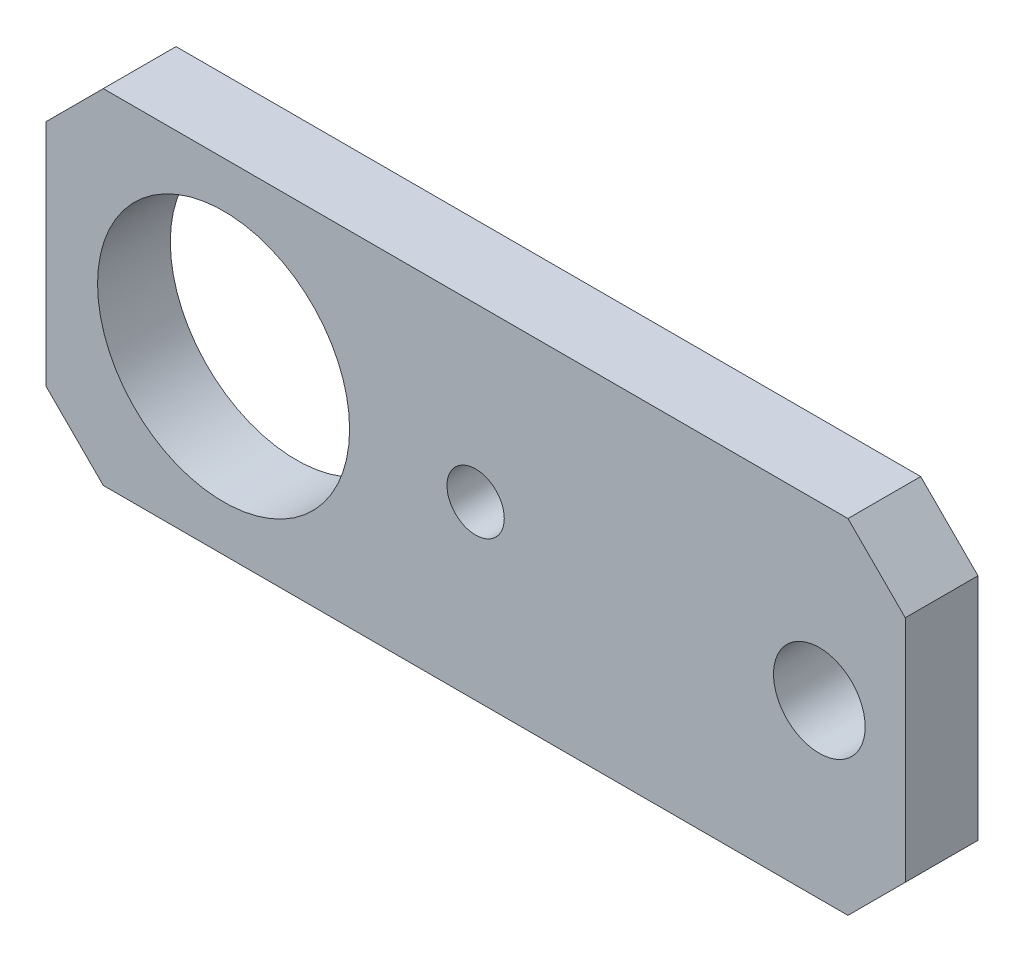
ISO-10303-21;
HEADER;
FILE_DESCRIPTION(('STEP AP214'),'2;1');
FILE_NAME('part.step','',(''),(''),'','','');
FILE_SCHEMA(('AUTOMOTIVE_DESIGN { 1 0 10303 214 1 1 1 1 }'));
ENDSEC;
DATA;
#1=APPLICATION_CONTEXT('core data for automotive mechanical design processes');
#2=APPLICATION_PROTOCOL_DEFINITION('international standard','automotive_design',2000,#1);
#3=PRODUCT_CONTEXT('',#1,'mechanical');
#4=PRODUCT('Part','Part','',(#3));
#5=PRODUCT_RELATED_PRODUCT_CATEGORY('part','',(#4));
#6=PRODUCT_DEFINITION_FORMATION('','',#4);
#7=PRODUCT_DEFINITION_CONTEXT('part definition',#1,'design');
#8=PRODUCT_DEFINITION('design','',#6,#7);
#9=PRODUCT_DEFINITION_SHAPE('','',#8);
#10=(LENGTH_UNIT() NAMED_UNIT(*) SI_UNIT(.MILLI.,.METRE.));
#11=(NAMED_UNIT(*) PLANE_ANGLE_UNIT() SI_UNIT($,.RADIAN.));
#12=(NAMED_UNIT(*) SI_UNIT($,.STERADIAN.) SOLID_ANGLE_UNIT());
#13=UNCERTAINTY_MEASURE_WITH_UNIT(LENGTH_MEASURE(1.E-05),#10,'distance_accuracy_value','');
#14=(GEOMETRIC_REPRESENTATION_CONTEXT(3) GLOBAL_UNCERTAINTY_ASSIGNED_CONTEXT((#13)) GLOBAL_UNIT_ASSIGNED_CONTEXT((#10,
#11,#12)) REPRESENTATION_CONTEXT('',''));
#15=CARTESIAN_POINT('',(0.,0.,0.));
#16=DIRECTION('',(0.,0.,1.));
#17=DIRECTION('',(1.,0.,0.));
#18=AXIS2_PLACEMENT_3D('',#15,#16,#17);
#19=CARTESIAN_POINT('',(0.,0.,6.35));
#20=DIRECTION('',(0.,0.,1.));
#21=DIRECTION('',(1.,0.,0.));
#22=AXIS2_PLACEMENT_3D('',#19,#20,#21);
#23=PLANE('',#22);
#24=CARTESIAN_POINT('',(0.,0.,6.35));
#25=DIRECTION('',(0.,0.,1.));
#26=DIRECTION('',(1.,0.,0.));
#27=AXIS2_PLACEMENT_3D('',#24,#25,#26);
#28=CIRCLE('',#27,2.5);
#29=CARTESIAN_POINT('',(2.5,0.,6.35));
#30=VERTEX_POINT('',#29);
#31=EDGE_CURVE('E179',#30,#30,#28,.T.);
#32=ORIENTED_EDGE('',*,*,#31,.F.);
#33=EDGE_LOOP('',(#32));
#34=FACE_BOUND('',#33,.T.);
#35=DIRECTION('',(1.,0.,0.));
#36=VECTOR('',#35,1.);
#37=CARTESIAN_POINT('',(-37.5,-15.,6.35));
#38=LINE('',#37,#36);
#39=CARTESIAN_POINT('',(-32.5,-15.,6.35));
#40=VERTEX_POINT('',#39);
#41=CARTESIAN_POINT('',(32.5,-15.,6.35));
#42=VERTEX_POINT('',#41);
#43=EDGE_CURVE('E135',#40,#42,#38,.T.);
#44=ORIENTED_EDGE('',*,*,#43,.T.);
#45=DIRECTION('',(-0.707106781186548,-0.707106781186547,0.));
#46=VECTOR('',#45,1.);
#47=CARTESIAN_POINT('',(23.75,-23.75,6.35));
#48=LINE('',#47,#46);
#49=CARTESIAN_POINT('',(37.5,-9.99999999999998,6.35));
#50=VERTEX_POINT('',#49);
#51=EDGE_CURVE('E154',#42,#50,#48,.F.);
#52=ORIENTED_EDGE('',*,*,#51,.T.);
#53=DIRECTION('',(0.,1.,0.));
#54=VECTOR('',#53,1.);
#55=CARTESIAN_POINT('',(37.5,15.,6.35));
#56=LINE('',#55,#54);
#57=CARTESIAN_POINT('',(37.5,9.99999999999997,6.35));
#58=VERTEX_POINT('',#57);
#59=EDGE_CURVE('E118',#50,#58,#56,.T.);
#60=ORIENTED_EDGE('',*,*,#59,.T.);
#61=DIRECTION('',(0.707106781186546,-0.70710678118655,0.));
#62=VECTOR('',#61,1.);
#63=CARTESIAN_POINT('',(23.7500000000001,23.75,6.35));
#64=LINE('',#63,#62);
#65=CARTESIAN_POINT('',(32.5,15.,6.35));
#66=VERTEX_POINT('',#65);
#67=EDGE_CURVE('E152',#58,#66,#64,.F.);
#68=ORIENTED_EDGE('',*,*,#67,.T.);
#69=DIRECTION('',(-1.,0.,0.));
#70=VECTOR('',#69,1.);
#71=CARTESIAN_POINT('',(-37.5,15.,6.35));
#72=LINE('',#71,#70);
#73=CARTESIAN_POINT('',(-32.5,15.,6.35));
#74=VERTEX_POINT('',#73);
#75=EDGE_CURVE('E174',#66,#74,#72,.T.);
#76=ORIENTED_EDGE('',*,*,#75,.T.);
#77=DIRECTION('',(0.707106781186549,0.707106781186546,0.));
#78=VECTOR('',#77,1.);
#79=CARTESIAN_POINT('',(-23.7499999999999,23.75,6.35));
#80=LINE('',#79,#78);
#81=CARTESIAN_POINT('',(-37.5,10.,6.35));
#82=VERTEX_POINT('',#81);
#83=EDGE_CURVE('E53',#74,#82,#80,.F.);
#84=ORIENTED_EDGE('',*,*,#83,.T.);
#85=DIRECTION('',(0.,-1.,0.));
#86=VECTOR('',#85,1.);
#87=CARTESIAN_POINT('',(-37.5,15.,6.35));
#88=LINE('',#87,#86);
#89=CARTESIAN_POINT('',(-37.5,-9.99999999999998,6.35));
#90=VERTEX_POINT('',#89);
#91=EDGE_CURVE('E164',#82,#90,#88,.T.);
#92=ORIENTED_EDGE('',*,*,#91,.T.);
#93=DIRECTION('',(-0.707106781186547,0.707106781186548,0.));
#94=VECTOR('',#93,1.);
#95=CARTESIAN_POINT('',(-23.75,-23.75,6.35));
#96=LINE('',#95,#94);
#97=EDGE_CURVE('E150',#90,#40,#96,.F.);
#98=ORIENTED_EDGE('',*,*,#97,.T.);
#99=EDGE_LOOP('',(#44,#52,#60,#68,#76,#84,#92,#98));
#100=FACE_BOUND('',#99,.T.);
#101=CARTESIAN_POINT('',(-22.,0.,6.35));
#102=DIRECTION('',(0.,0.,1.));
#103=DIRECTION('',(1.,0.,0.));
#104=AXIS2_PLACEMENT_3D('',#101,#102,#103);
#105=CIRCLE('',#104,11.);
#106=CARTESIAN_POINT('',(-11.,0.,6.35));
#107=VERTEX_POINT('',#106);
#108=EDGE_CURVE('E126',#107,#107,#105,.T.);
#109=ORIENTED_EDGE('',*,*,#108,.F.);
#110=EDGE_LOOP('',(#109));
#111=FACE_BOUND('',#110,.T.);
#112=CARTESIAN_POINT('',(30.,0.,6.35));
#113=DIRECTION('',(0.,0.,1.));
#114=DIRECTION('',(1.,0.,0.));
#115=AXIS2_PLACEMENT_3D('',#112,#113,#114);
#116=CIRCLE('',#115,4.00000000000001);
#117=CARTESIAN_POINT('',(34.,0.,6.35));
#118=VERTEX_POINT('',#117);
#119=EDGE_CURVE('E184',#118,#118,#116,.T.);
#120=ORIENTED_EDGE('',*,*,#119,.F.);
#121=EDGE_LOOP('',(#120));
#122=FACE_BOUND('',#121,.T.);
#123=ADVANCED_FACE('F33',(#34,#100,#111,#122),#23,.T.);
#124=CARTESIAN_POINT('',(0.,0.,0.));
#125=DIRECTION('',(0.,0.,1.));
#126=DIRECTION('',(1.,0.,0.));
#127=AXIS2_PLACEMENT_3D('',#124,#125,#126);
#128=PLANE('',#127);
#129=DIRECTION('',(0.,1.,0.));
#130=VECTOR('',#129,1.);
#131=CARTESIAN_POINT('',(37.5,15.,0.));
#132=LINE('',#131,#130);
#133=CARTESIAN_POINT('',(37.5,-9.99999999999998,0.));
#134=VERTEX_POINT('',#133);
#135=CARTESIAN_POINT('',(37.5,9.99999999999997,0.));
#136=VERTEX_POINT('',#135);
#137=EDGE_CURVE('E115',#134,#136,#132,.T.);
#138=ORIENTED_EDGE('',*,*,#137,.F.);
#139=DIRECTION('',(0.707106781186548,0.707106781186547,0.));
#140=VECTOR('',#139,1.);
#141=CARTESIAN_POINT('',(37.5,-9.99999999999999,0.));
#142=LINE('',#141,#140);
#143=CARTESIAN_POINT('',(32.5,-15.,0.));
#144=VERTEX_POINT('',#143);
#145=EDGE_CURVE('E98',#134,#144,#142,.F.);
#146=ORIENTED_EDGE('',*,*,#145,.T.);
#147=DIRECTION('',(1.,0.,0.));
#148=VECTOR('',#147,1.);
#149=CARTESIAN_POINT('',(-37.5,-15.,0.));
#150=LINE('',#149,#148);
#151=CARTESIAN_POINT('',(-32.5,-15.,0.));
#152=VERTEX_POINT('',#151);
#153=EDGE_CURVE('E139',#152,#144,#150,.T.);
#154=ORIENTED_EDGE('',*,*,#153,.F.);
#155=DIRECTION('',(0.707106781186547,-0.707106781186548,0.));
#156=VECTOR('',#155,1.);
#157=CARTESIAN_POINT('',(-32.5,-15.,0.));
#158=LINE('',#157,#156);
#159=CARTESIAN_POINT('',(-37.5,-9.99999999999998,0.));
#160=VERTEX_POINT('',#159);
#161=EDGE_CURVE('E143',#152,#160,#158,.F.);
#162=ORIENTED_EDGE('',*,*,#161,.T.);
#163=DIRECTION('',(0.,-1.,0.));
#164=VECTOR('',#163,1.);
#165=CARTESIAN_POINT('',(-37.5,15.,0.));
#166=LINE('',#165,#164);
#167=CARTESIAN_POINT('',(-37.5,10.,0.));
#168=VERTEX_POINT('',#167);
#169=EDGE_CURVE('E129',#168,#160,#166,.T.);
#170=ORIENTED_EDGE('',*,*,#169,.F.);
#171=DIRECTION('',(-0.707106781186549,-0.707106781186546,0.));
#172=VECTOR('',#171,1.);
#173=CARTESIAN_POINT('',(-37.5,10.,0.));
#174=LINE('',#173,#172);
#175=CARTESIAN_POINT('',(-32.5,15.,0.));
#176=VERTEX_POINT('',#175);
#177=EDGE_CURVE('E119',#168,#176,#174,.F.);
#178=ORIENTED_EDGE('',*,*,#177,.T.);
#179=DIRECTION('',(-1.,0.,0.));
#180=VECTOR('',#179,1.);
#181=CARTESIAN_POINT('',(-37.5,15.,0.));
#182=LINE('',#181,#180);
#183=CARTESIAN_POINT('',(32.5,15.,0.));
#184=VERTEX_POINT('',#183);
#185=EDGE_CURVE('E125',#184,#176,#182,.T.);
#186=ORIENTED_EDGE('',*,*,#185,.F.);
#187=DIRECTION('',(-0.707106781186546,0.70710678118655,0.));
#188=VECTOR('',#187,1.);
#189=CARTESIAN_POINT('',(32.5,15.,0.));
#190=LINE('',#189,#188);
#191=EDGE_CURVE('E109',#184,#136,#190,.F.);
#192=ORIENTED_EDGE('',*,*,#191,.T.);
#193=EDGE_LOOP('',(#138,#146,#154,#162,#170,#178,#186,#192));
#194=FACE_BOUND('',#193,.T.);
#195=CARTESIAN_POINT('',(-22.,0.,0.));
#196=DIRECTION('',(0.,0.,1.));
#197=DIRECTION('',(1.,0.,0.));
#198=AXIS2_PLACEMENT_3D('',#195,#196,#197);
#199=CIRCLE('',#198,11.);
#200=CARTESIAN_POINT('',(-11.,0.,0.));
#201=VERTEX_POINT('',#200);
#202=EDGE_CURVE('E132',#201,#201,#199,.T.);
#203=ORIENTED_EDGE('',*,*,#202,.T.);
#204=EDGE_LOOP('',(#203));
#205=FACE_BOUND('',#204,.T.);
#206=CARTESIAN_POINT('',(0.,0.,0.));
#207=DIRECTION('',(0.,0.,1.));
#208=DIRECTION('',(1.,0.,0.));
#209=AXIS2_PLACEMENT_3D('',#206,#207,#208);
#210=CIRCLE('',#209,2.5);
#211=CARTESIAN_POINT('',(2.5,0.,0.));
#212=VERTEX_POINT('',#211);
#213=EDGE_CURVE('E181',#212,#212,#210,.T.);
#214=ORIENTED_EDGE('',*,*,#213,.T.);
#215=EDGE_LOOP('',(#214));
#216=FACE_BOUND('',#215,.T.);
#217=CARTESIAN_POINT('',(30.,0.,0.));
#218=DIRECTION('',(0.,0.,1.));
#219=DIRECTION('',(1.,0.,0.));
#220=AXIS2_PLACEMENT_3D('',#217,#218,#219);
#221=CIRCLE('',#220,4.00000000000001);
#222=CARTESIAN_POINT('',(34.,0.,0.));
#223=VERTEX_POINT('',#222);
#224=EDGE_CURVE('E187',#223,#223,#221,.T.);
#225=ORIENTED_EDGE('',*,*,#224,.T.);
#226=EDGE_LOOP('',(#225));
#227=FACE_BOUND('',#226,.T.);
#228=ADVANCED_FACE('F122',(#194,#205,#216,#227),#128,.F.);
#229=CARTESIAN_POINT('',(37.5,15.,6.35));
#230=DIRECTION('',(-1.,0.,0.));
#231=DIRECTION('',(0.,0.,1.));
#232=AXIS2_PLACEMENT_3D('',#229,#230,#231);
#233=PLANE('',#232);
#234=ORIENTED_EDGE('',*,*,#59,.F.);
#235=DIRECTION('',(0.,0.,-1.));
#236=VECTOR('',#235,1.);
#237=CARTESIAN_POINT('',(37.5,-9.99999999999999,6.35));
#238=LINE('',#237,#236);
#239=EDGE_CURVE('E102',#50,#134,#238,.T.);
#240=ORIENTED_EDGE('',*,*,#239,.T.);
#241=ORIENTED_EDGE('',*,*,#137,.T.);
#242=DIRECTION('',(0.,0.,1.));
#243=VECTOR('',#242,1.);
#244=CARTESIAN_POINT('',(37.5,9.99999999999997,6.35));
#245=LINE('',#244,#243);
#246=EDGE_CURVE('E120',#136,#58,#245,.T.);
#247=ORIENTED_EDGE('',*,*,#246,.T.);
#248=EDGE_LOOP('',(#234,#240,#241,#247));
#249=FACE_BOUND('',#248,.T.);
#250=ADVANCED_FACE('F114',(#249),#233,.F.);
#251=CARTESIAN_POINT('',(-37.5,15.,6.35));
#252=DIRECTION('',(0.,-1.,0.));
#253=DIRECTION('',(1.,0.,0.));
#254=AXIS2_PLACEMENT_3D('',#251,#252,#253);
#255=PLANE('',#254);
#256=ORIENTED_EDGE('',*,*,#75,.F.);
#257=DIRECTION('',(0.,0.,-1.));
#258=VECTOR('',#257,1.);
#259=CARTESIAN_POINT('',(32.5,15.,6.35));
#260=LINE('',#259,#258);
#261=EDGE_CURVE('E158',#66,#184,#260,.T.);
#262=ORIENTED_EDGE('',*,*,#261,.T.);
#263=ORIENTED_EDGE('',*,*,#185,.T.);
#264=DIRECTION('',(0.,0.,1.));
#265=VECTOR('',#264,1.);
#266=CARTESIAN_POINT('',(-32.5,15.,6.35));
#267=LINE('',#266,#265);
#268=EDGE_CURVE('E156',#176,#74,#267,.T.);
#269=ORIENTED_EDGE('',*,*,#268,.T.);
#270=EDGE_LOOP('',(#256,#262,#263,#269));
#271=FACE_BOUND('',#270,.T.);
#272=ADVANCED_FACE('F212',(#271),#255,.F.);
#273=CARTESIAN_POINT('',(-37.5,15.,6.35));
#274=DIRECTION('',(1.,0.,0.));
#275=DIRECTION('',(0.,1.,0.));
#276=AXIS2_PLACEMENT_3D('',#273,#274,#275);
#277=PLANE('',#276);
#278=ORIENTED_EDGE('',*,*,#169,.T.);
#279=DIRECTION('',(0.,0.,1.));
#280=VECTOR('',#279,1.);
#281=CARTESIAN_POINT('',(-37.5,-9.99999999999998,6.35));
#282=LINE('',#281,#280);
#283=EDGE_CURVE('E11',#160,#90,#282,.T.);
#284=ORIENTED_EDGE('',*,*,#283,.T.);
#285=ORIENTED_EDGE('',*,*,#91,.F.);
#286=DIRECTION('',(0.,0.,-1.));
#287=VECTOR('',#286,1.);
#288=CARTESIAN_POINT('',(-37.5,10.,6.35));
#289=LINE('',#288,#287);
#290=EDGE_CURVE('E41',#82,#168,#289,.T.);
#291=ORIENTED_EDGE('',*,*,#290,.T.);
#292=EDGE_LOOP('',(#278,#284,#285,#291));
#293=FACE_BOUND('',#292,.T.);
#294=ADVANCED_FACE('F163',(#293),#277,.F.);
#295=CARTESIAN_POINT('',(-37.5,-15.,6.35));
#296=DIRECTION('',(0.,1.,0.));
#297=DIRECTION('',(-1.,0.,0.));
#298=AXIS2_PLACEMENT_3D('',#295,#296,#297);
#299=PLANE('',#298);
#300=ORIENTED_EDGE('',*,*,#153,.T.);
#301=DIRECTION('',(0.,0.,1.));
#302=VECTOR('',#301,1.);
#303=CARTESIAN_POINT('',(32.5,-15.,6.35));
#304=LINE('',#303,#302);
#305=EDGE_CURVE('E103',#144,#42,#304,.T.);
#306=ORIENTED_EDGE('',*,*,#305,.T.);
#307=ORIENTED_EDGE('',*,*,#43,.F.);
#308=DIRECTION('',(0.,0.,-1.));
#309=VECTOR('',#308,1.);
#310=CARTESIAN_POINT('',(-32.5,-15.,6.35));
#311=LINE('',#310,#309);
#312=EDGE_CURVE('E108',#40,#152,#311,.T.);
#313=ORIENTED_EDGE('',*,*,#312,.T.);
#314=EDGE_LOOP('',(#300,#306,#307,#313));
#315=FACE_BOUND('',#314,.T.);
#316=ADVANCED_FACE('F172',(#315),#299,.F.);
#317=CARTESIAN_POINT('',(-22.,0.,6.35));
#318=DIRECTION('',(0.,0.,-1.));
#319=DIRECTION('',(-1.,0.,0.));
#320=AXIS2_PLACEMENT_3D('',#317,#318,#319);
#321=CYLINDRICAL_SURFACE('',#320,11.);
#322=ORIENTED_EDGE('',*,*,#108,.T.);
#323=EDGE_LOOP('',(#322));
#324=FACE_BOUND('',#323,.T.);
#325=ORIENTED_EDGE('',*,*,#202,.F.);
#326=EDGE_LOOP('',(#325));
#327=FACE_BOUND('',#326,.T.);
#328=ADVANCED_FACE('F205',(#324,#327),#321,.F.);
#329=CARTESIAN_POINT('',(0.,0.,6.35));
#330=DIRECTION('',(0.,0.,-1.));
#331=DIRECTION('',(-1.,0.,0.));
#332=AXIS2_PLACEMENT_3D('',#329,#330,#331);
#333=CYLINDRICAL_SURFACE('',#332,2.5);
#334=ORIENTED_EDGE('',*,*,#31,.T.);
#335=EDGE_LOOP('',(#334));
#336=FACE_BOUND('',#335,.T.);
#337=ORIENTED_EDGE('',*,*,#213,.F.);
#338=EDGE_LOOP('',(#337));
#339=FACE_BOUND('',#338,.T.);
#340=ADVANCED_FACE('F238',(#336,#339),#333,.F.);
#341=CARTESIAN_POINT('',(30.,0.,6.35));
#342=DIRECTION('',(0.,0.,-1.));
#343=DIRECTION('',(-1.,0.,0.));
#344=AXIS2_PLACEMENT_3D('',#341,#342,#343);
#345=CYLINDRICAL_SURFACE('',#344,4.00000000000001);
#346=ORIENTED_EDGE('',*,*,#119,.T.);
#347=EDGE_LOOP('',(#346));
#348=FACE_BOUND('',#347,.T.);
#349=ORIENTED_EDGE('',*,*,#224,.F.);
#350=EDGE_LOOP('',(#349));
#351=FACE_BOUND('',#350,.T.);
#352=ADVANCED_FACE('F193',(#348,#351),#345,.F.);
#353=CARTESIAN_POINT('',(37.5,-9.99999999999999,6.35));
#354=DIRECTION('',(-0.707106781186547,0.707106781186548,0.));
#355=DIRECTION('',(0.,0.,-1.));
#356=AXIS2_PLACEMENT_3D('',#353,#354,#355);
#357=PLANE('',#356);
#358=ORIENTED_EDGE('',*,*,#51,.F.);
#359=ORIENTED_EDGE('',*,*,#305,.F.);
#360=ORIENTED_EDGE('',*,*,#145,.F.);
#361=ORIENTED_EDGE('',*,*,#239,.F.);
#362=EDGE_LOOP('',(#358,#359,#360,#361));
#363=FACE_BOUND('',#362,.T.);
#364=ADVANCED_FACE('F101',(#363),#357,.F.);
#365=CARTESIAN_POINT('',(32.5,15.,6.35));
#366=DIRECTION('',(-0.70710678118655,-0.707106781186546,0.));
#367=DIRECTION('',(0.,0.,-1.));
#368=AXIS2_PLACEMENT_3D('',#365,#366,#367);
#369=PLANE('',#368);
#370=ORIENTED_EDGE('',*,*,#67,.F.);
#371=ORIENTED_EDGE('',*,*,#246,.F.);
#372=ORIENTED_EDGE('',*,*,#191,.F.);
#373=ORIENTED_EDGE('',*,*,#261,.F.);
#374=EDGE_LOOP('',(#370,#371,#372,#373));
#375=FACE_BOUND('',#374,.T.);
#376=ADVANCED_FACE('F220',(#375),#369,.F.);
#377=CARTESIAN_POINT('',(-32.5,-15.,6.35));
#378=DIRECTION('',(0.707106781186548,0.707106781186547,0.));
#379=DIRECTION('',(0.,0.,-1.));
#380=AXIS2_PLACEMENT_3D('',#377,#378,#379);
#381=PLANE('',#380);
#382=ORIENTED_EDGE('',*,*,#97,.F.);
#383=ORIENTED_EDGE('',*,*,#283,.F.);
#384=ORIENTED_EDGE('',*,*,#161,.F.);
#385=ORIENTED_EDGE('',*,*,#312,.F.);
#386=EDGE_LOOP('',(#382,#383,#384,#385));
#387=FACE_BOUND('',#386,.T.);
#388=ADVANCED_FACE('F169',(#387),#381,.F.);
#389=CARTESIAN_POINT('',(-37.5,10.,6.35));
#390=DIRECTION('',(0.707106781186546,-0.707106781186549,0.));
#391=DIRECTION('',(0.,0.,-1.));
#392=AXIS2_PLACEMENT_3D('',#389,#390,#391);
#393=PLANE('',#392);
#394=ORIENTED_EDGE('',*,*,#83,.F.);
#395=ORIENTED_EDGE('',*,*,#268,.F.);
#396=ORIENTED_EDGE('',*,*,#177,.F.);
#397=ORIENTED_EDGE('',*,*,#290,.F.);
#398=EDGE_LOOP('',(#394,#395,#396,#397));
#399=FACE_BOUND('',#398,.T.);
#400=ADVANCED_FACE('F35',(#399),#393,.F.);
#401=CLOSED_SHELL('',(#123,#228,#250,#272,#294,#316,#328,#340,#352,#364,#376,#388,#400));
#402=MANIFOLD_SOLID_BREP('B2',#401);
#403=ADVANCED_BREP_SHAPE_REPRESENTATION('',(#18,#402),#14);
#404=SHAPE_DEFINITION_REPRESENTATION(#9,#403);
ENDSEC;
END-ISO-10303-21;
